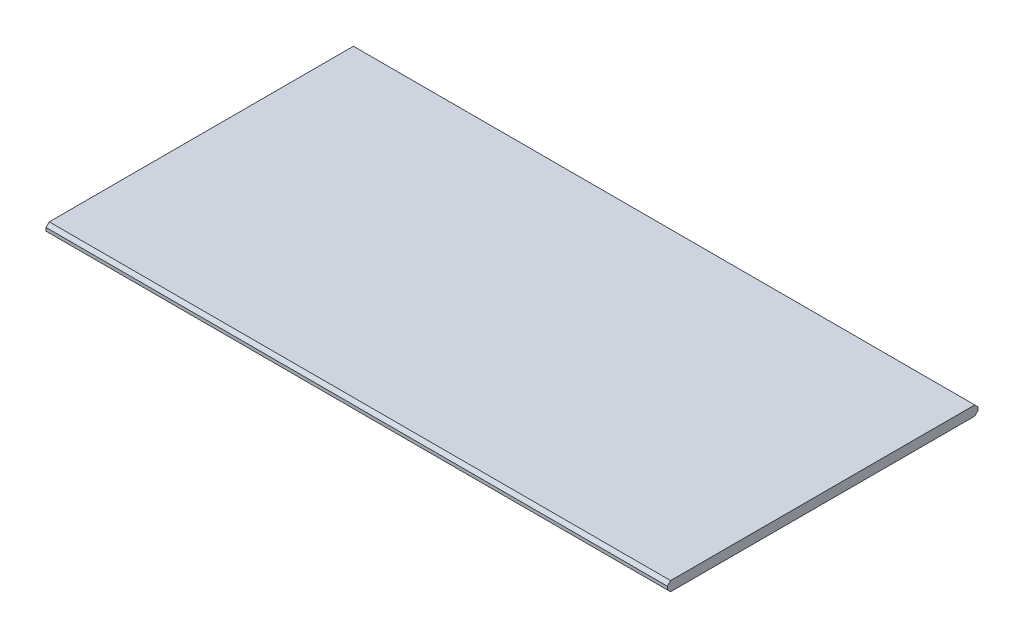
ISO-10303-21;
HEADER;
FILE_DESCRIPTION(('STEP AP214'),'2;1');
FILE_NAME('part.step','',(''),(''),'','','');
FILE_SCHEMA(('AUTOMOTIVE_DESIGN { 1 0 10303 214 1 1 1 1 }'));
ENDSEC;
DATA;
#1=APPLICATION_CONTEXT('core data for automotive mechanical design processes');
#2=APPLICATION_PROTOCOL_DEFINITION('international standard','automotive_design',2000,#1);
#3=PRODUCT_CONTEXT('',#1,'mechanical');
#4=PRODUCT('Part','Part','',(#3));
#5=PRODUCT_RELATED_PRODUCT_CATEGORY('part','',(#4));
#6=PRODUCT_DEFINITION_FORMATION('','',#4);
#7=PRODUCT_DEFINITION_CONTEXT('part definition',#1,'design');
#8=PRODUCT_DEFINITION('design','',#6,#7);
#9=PRODUCT_DEFINITION_SHAPE('','',#8);
#10=(LENGTH_UNIT() NAMED_UNIT(*) SI_UNIT(.MILLI.,.METRE.));
#11=(NAMED_UNIT(*) PLANE_ANGLE_UNIT() SI_UNIT($,.RADIAN.));
#12=(NAMED_UNIT(*) SI_UNIT($,.STERADIAN.) SOLID_ANGLE_UNIT());
#13=UNCERTAINTY_MEASURE_WITH_UNIT(LENGTH_MEASURE(1.E-05),#10,'distance_accuracy_value','');
#14=(GEOMETRIC_REPRESENTATION_CONTEXT(3) GLOBAL_UNCERTAINTY_ASSIGNED_CONTEXT((#13)) GLOBAL_UNIT_ASSIGNED_CONTEXT((#10,
#11,#12)) REPRESENTATION_CONTEXT('',''));
#15=CARTESIAN_POINT('',(0.,0.,0.));
#16=DIRECTION('',(0.,0.,1.));
#17=DIRECTION('',(1.,0.,0.));
#18=AXIS2_PLACEMENT_3D('',#15,#16,#17);
#19=CARTESIAN_POINT('',(609.6,9.525,-304.8));
#20=DIRECTION('',(-1.,0.,0.));
#21=DIRECTION('',(0.,0.,1.));
#22=AXIS2_PLACEMENT_3D('',#19,#20,#21);
#23=PLANE('',#22);
#24=DIRECTION('',(0.,0.,-1.));
#25=VECTOR('',#24,1.);
#26=CARTESIAN_POINT('',(609.6,-9.525,-304.8));
#27=LINE('',#26,#25);
#28=CARTESIAN_POINT('',(609.6,-9.525,298.45));
#29=VERTEX_POINT('',#28);
#30=CARTESIAN_POINT('',(609.6,-9.525,-298.45));
#31=VERTEX_POINT('',#30);
#32=EDGE_CURVE('E170',#29,#31,#27,.T.);
#33=ORIENTED_EDGE('',*,*,#32,.T.);
#34=DIRECTION('',(0.,-0.707106781186548,0.707106781186548));
#35=VECTOR('',#34,1.);
#36=CARTESIAN_POINT('',(609.6,-3.17499999999981,-304.8));
#37=LINE('',#36,#35);
#38=CARTESIAN_POINT('',(609.6,-3.17500000000003,-304.8));
#39=VERTEX_POINT('',#38);
#40=EDGE_CURVE('E144',#31,#39,#37,.F.);
#41=ORIENTED_EDGE('',*,*,#40,.T.);
#42=DIRECTION('',(0.,-1.,0.));
#43=VECTOR('',#42,1.);
#44=CARTESIAN_POINT('',(609.6,9.525,-304.8));
#45=LINE('',#44,#43);
#46=CARTESIAN_POINT('',(609.6,3.17500000000003,-304.8));
#47=VERTEX_POINT('',#46);
#48=EDGE_CURVE('E123',#47,#39,#45,.T.);
#49=ORIENTED_EDGE('',*,*,#48,.F.);
#50=DIRECTION('',(0.,0.707106781186541,0.707106781186554));
#51=VECTOR('',#50,1.);
#52=CARTESIAN_POINT('',(609.6,9.52499999999989,-298.45));
#53=LINE('',#52,#51);
#54=CARTESIAN_POINT('',(609.6,9.525,-298.45));
#55=VERTEX_POINT('',#54);
#56=EDGE_CURVE('E128',#47,#55,#53,.T.);
#57=ORIENTED_EDGE('',*,*,#56,.T.);
#58=DIRECTION('',(0.,0.,-1.));
#59=VECTOR('',#58,1.);
#60=CARTESIAN_POINT('',(609.6,9.525,-304.8));
#61=LINE('',#60,#59);
#62=CARTESIAN_POINT('',(609.6,9.52500000000006,298.45));
#63=VERTEX_POINT('',#62);
#64=EDGE_CURVE('E165',#63,#55,#61,.T.);
#65=ORIENTED_EDGE('',*,*,#64,.F.);
#66=DIRECTION('',(0.,-0.707106781186541,0.707106781186554));
#67=VECTOR('',#66,1.);
#68=CARTESIAN_POINT('',(609.6,9.52500000000011,298.45));
#69=LINE('',#68,#67);
#70=CARTESIAN_POINT('',(609.6,3.17500000000015,304.8));
#71=VERTEX_POINT('',#70);
#72=EDGE_CURVE('E58',#63,#71,#69,.T.);
#73=ORIENTED_EDGE('',*,*,#72,.T.);
#74=DIRECTION('',(0.,-1.,0.));
#75=VECTOR('',#74,1.);
#76=CARTESIAN_POINT('',(609.6,9.525,304.8));
#77=LINE('',#76,#75);
#78=CARTESIAN_POINT('',(609.6,-3.17499999999992,304.8));
#79=VERTEX_POINT('',#78);
#80=EDGE_CURVE('E155',#71,#79,#77,.T.);
#81=ORIENTED_EDGE('',*,*,#80,.T.);
#82=DIRECTION('',(0.,0.707106781186548,0.707106781186548));
#83=VECTOR('',#82,1.);
#84=CARTESIAN_POINT('',(609.6,-3.17500000000014,304.8));
#85=LINE('',#84,#83);
#86=EDGE_CURVE('E51',#79,#29,#85,.F.);
#87=ORIENTED_EDGE('',*,*,#86,.T.);
#88=EDGE_LOOP('',(#33,#41,#49,#57,#65,#73,#81,#87));
#89=FACE_BOUND('',#88,.T.);
#90=ADVANCED_FACE('F36',(#89),#23,.F.);
#91=CARTESIAN_POINT('',(-609.6,9.525,-304.8));
#92=DIRECTION('',(0.,0.,1.));
#93=DIRECTION('',(1.,0.,0.));
#94=AXIS2_PLACEMENT_3D('',#91,#92,#93);
#95=PLANE('',#94);
#96=ORIENTED_EDGE('',*,*,#48,.T.);
#97=DIRECTION('',(-1.,0.,0.));
#98=VECTOR('',#97,1.);
#99=CARTESIAN_POINT('',(-609.6,-3.17500000000003,-304.8));
#100=LINE('',#99,#98);
#101=CARTESIAN_POINT('',(-609.6,-3.17500000000003,-304.8));
#102=VERTEX_POINT('',#101);
#103=EDGE_CURVE('E122',#39,#102,#100,.T.);
#104=ORIENTED_EDGE('',*,*,#103,.T.);
#105=DIRECTION('',(0.,-1.,0.));
#106=VECTOR('',#105,1.);
#107=CARTESIAN_POINT('',(-609.6,9.525,-304.8));
#108=LINE('',#107,#106);
#109=CARTESIAN_POINT('',(-609.6,3.17500000000004,-304.8));
#110=VERTEX_POINT('',#109);
#111=EDGE_CURVE('E105',#110,#102,#108,.T.);
#112=ORIENTED_EDGE('',*,*,#111,.F.);
#113=DIRECTION('',(1.,0.,0.));
#114=VECTOR('',#113,1.);
#115=CARTESIAN_POINT('',(609.6,3.17500000000003,-304.8));
#116=LINE('',#115,#114);
#117=EDGE_CURVE('E119',#110,#47,#116,.T.);
#118=ORIENTED_EDGE('',*,*,#117,.T.);
#119=EDGE_LOOP('',(#96,#104,#112,#118));
#120=FACE_BOUND('',#119,.T.);
#121=ADVANCED_FACE('F118',(#120),#95,.F.);
#122=CARTESIAN_POINT('',(-609.6,9.525,-304.8));
#123=DIRECTION('',(1.,0.,0.));
#124=DIRECTION('',(0.,0.,-1.));
#125=AXIS2_PLACEMENT_3D('',#122,#123,#124);
#126=PLANE('',#125);
#127=ORIENTED_EDGE('',*,*,#111,.T.);
#128=DIRECTION('',(0.,0.707106781186548,-0.707106781186548));
#129=VECTOR('',#128,1.);
#130=CARTESIAN_POINT('',(-609.6,-3.17500000000003,-304.8));
#131=LINE('',#130,#129);
#132=CARTESIAN_POINT('',(-609.6,-9.525,-298.45));
#133=VERTEX_POINT('',#132);
#134=EDGE_CURVE('E112',#102,#133,#131,.F.);
#135=ORIENTED_EDGE('',*,*,#134,.T.);
#136=DIRECTION('',(0.,0.,1.));
#137=VECTOR('',#136,1.);
#138=CARTESIAN_POINT('',(-609.6,-9.525,-304.8));
#139=LINE('',#138,#137);
#140=CARTESIAN_POINT('',(-609.6,-9.52500000000006,298.45));
#141=VERTEX_POINT('',#140);
#142=EDGE_CURVE('E167',#133,#141,#139,.T.);
#143=ORIENTED_EDGE('',*,*,#142,.T.);
#144=DIRECTION('',(0.,-0.707106781186548,-0.707106781186548));
#145=VECTOR('',#144,1.);
#146=CARTESIAN_POINT('',(-609.6,-3.17499999999992,304.8));
#147=LINE('',#146,#145);
#148=CARTESIAN_POINT('',(-609.6,-3.17499999999992,304.8));
#149=VERTEX_POINT('',#148);
#150=EDGE_CURVE('E113',#141,#149,#147,.F.);
#151=ORIENTED_EDGE('',*,*,#150,.T.);
#152=DIRECTION('',(0.,-1.,0.));
#153=VECTOR('',#152,1.);
#154=CARTESIAN_POINT('',(-609.6,9.525,304.8));
#155=LINE('',#154,#153);
#156=CARTESIAN_POINT('',(-609.6,3.17500000000015,304.8));
#157=VERTEX_POINT('',#156);
#158=EDGE_CURVE('E124',#157,#149,#155,.T.);
#159=ORIENTED_EDGE('',*,*,#158,.F.);
#160=DIRECTION('',(0.,0.707106781186541,-0.707106781186554));
#161=VECTOR('',#160,1.);
#162=CARTESIAN_POINT('',(-609.6,9.52499999999989,298.45));
#163=LINE('',#162,#161);
#164=CARTESIAN_POINT('',(-609.6,9.52500000000003,298.45));
#165=VERTEX_POINT('',#164);
#166=EDGE_CURVE('E130',#157,#165,#163,.T.);
#167=ORIENTED_EDGE('',*,*,#166,.T.);
#168=DIRECTION('',(0.,0.,1.));
#169=VECTOR('',#168,1.);
#170=CARTESIAN_POINT('',(-609.6,9.525,-304.8));
#171=LINE('',#170,#169);
#172=CARTESIAN_POINT('',(-609.6,9.525,-298.45));
#173=VERTEX_POINT('',#172);
#174=EDGE_CURVE('E107',#173,#165,#171,.T.);
#175=ORIENTED_EDGE('',*,*,#174,.F.);
#176=DIRECTION('',(0.,-0.707106781186541,-0.707106781186554));
#177=VECTOR('',#176,1.);
#178=CARTESIAN_POINT('',(-609.6,9.52500000000011,-298.45));
#179=LINE('',#178,#177);
#180=EDGE_CURVE('E102',#173,#110,#179,.T.);
#181=ORIENTED_EDGE('',*,*,#180,.T.);
#182=EDGE_LOOP('',(#127,#135,#143,#151,#159,#167,#175,#181));
#183=FACE_BOUND('',#182,.T.);
#184=ADVANCED_FACE('F104',(#183),#126,.F.);
#185=CARTESIAN_POINT('',(-609.6,9.525,304.8));
#186=DIRECTION('',(0.,0.,-1.));
#187=DIRECTION('',(-1.,0.,0.));
#188=AXIS2_PLACEMENT_3D('',#185,#186,#187);
#189=PLANE('',#188);
#190=ORIENTED_EDGE('',*,*,#158,.T.);
#191=DIRECTION('',(1.,0.,0.));
#192=VECTOR('',#191,1.);
#193=CARTESIAN_POINT('',(-609.6,-3.17499999999992,304.8));
#194=LINE('',#193,#192);
#195=EDGE_CURVE('E11',#149,#79,#194,.T.);
#196=ORIENTED_EDGE('',*,*,#195,.T.);
#197=ORIENTED_EDGE('',*,*,#80,.F.);
#198=DIRECTION('',(-1.,0.,0.));
#199=VECTOR('',#198,1.);
#200=CARTESIAN_POINT('',(-609.6,3.17500000000015,304.8));
#201=LINE('',#200,#199);
#202=EDGE_CURVE('E44',#71,#157,#201,.T.);
#203=ORIENTED_EDGE('',*,*,#202,.T.);
#204=EDGE_LOOP('',(#190,#196,#197,#203));
#205=FACE_BOUND('',#204,.T.);
#206=ADVANCED_FACE('F154',(#205),#189,.F.);
#207=CARTESIAN_POINT('',(0.,9.525,0.));
#208=DIRECTION('',(0.,1.,0.));
#209=DIRECTION('',(0.,0.,1.));
#210=AXIS2_PLACEMENT_3D('',#207,#208,#209);
#211=PLANE('',#210);
#212=ORIENTED_EDGE('',*,*,#64,.T.);
#213=DIRECTION('',(-1.,0.,0.));
#214=VECTOR('',#213,1.);
#215=CARTESIAN_POINT('',(-609.6,9.525,-298.45));
#216=LINE('',#215,#214);
#217=EDGE_CURVE('E149',#55,#173,#216,.T.);
#218=ORIENTED_EDGE('',*,*,#217,.T.);
#219=ORIENTED_EDGE('',*,*,#174,.T.);
#220=DIRECTION('',(1.,0.,0.));
#221=VECTOR('',#220,1.);
#222=CARTESIAN_POINT('',(609.6,9.525,298.45));
#223=LINE('',#222,#221);
#224=EDGE_CURVE('E146',#165,#63,#223,.T.);
#225=ORIENTED_EDGE('',*,*,#224,.T.);
#226=EDGE_LOOP('',(#212,#218,#219,#225));
#227=FACE_BOUND('',#226,.T.);
#228=ADVANCED_FACE('F164',(#227),#211,.T.);
#229=CARTESIAN_POINT('',(0.,-9.525,0.));
#230=DIRECTION('',(0.,1.,0.));
#231=DIRECTION('',(0.,0.,1.));
#232=AXIS2_PLACEMENT_3D('',#229,#230,#231);
#233=PLANE('',#232);
#234=ORIENTED_EDGE('',*,*,#142,.F.);
#235=DIRECTION('',(1.,0.,0.));
#236=VECTOR('',#235,1.);
#237=CARTESIAN_POINT('',(0.,-9.525,-298.45));
#238=LINE('',#237,#236);
#239=EDGE_CURVE('E139',#133,#31,#238,.T.);
#240=ORIENTED_EDGE('',*,*,#239,.T.);
#241=ORIENTED_EDGE('',*,*,#32,.F.);
#242=DIRECTION('',(-1.,0.,0.));
#243=VECTOR('',#242,1.);
#244=CARTESIAN_POINT('',(0.,-9.525,298.45));
#245=LINE('',#244,#243);
#246=EDGE_CURVE('E137',#29,#141,#245,.T.);
#247=ORIENTED_EDGE('',*,*,#246,.T.);
#248=EDGE_LOOP('',(#234,#240,#241,#247));
#249=FACE_BOUND('',#248,.T.);
#250=ADVANCED_FACE('F178',(#249),#233,.F.);
#251=CARTESIAN_POINT('',(-609.6,-3.17500000000003,-304.8));
#252=DIRECTION('',(0.,0.707106781186548,0.707106781186548));
#253=DIRECTION('',(-1.,0.,0.));
#254=AXIS2_PLACEMENT_3D('',#251,#252,#253);
#255=PLANE('',#254);
#256=ORIENTED_EDGE('',*,*,#40,.F.);
#257=ORIENTED_EDGE('',*,*,#239,.F.);
#258=ORIENTED_EDGE('',*,*,#134,.F.);
#259=ORIENTED_EDGE('',*,*,#103,.F.);
#260=EDGE_LOOP('',(#256,#257,#258,#259));
#261=FACE_BOUND('',#260,.T.);
#262=ADVANCED_FACE('F186',(#261),#255,.F.);
#263=CARTESIAN_POINT('',(0.,9.525,-298.45));
#264=DIRECTION('',(0.,0.707106781186554,-0.707106781186541));
#265=DIRECTION('',(1.,0.,0.));
#266=AXIS2_PLACEMENT_3D('',#263,#264,#265);
#267=PLANE('',#266);
#268=ORIENTED_EDGE('',*,*,#56,.F.);
#269=ORIENTED_EDGE('',*,*,#117,.F.);
#270=ORIENTED_EDGE('',*,*,#180,.F.);
#271=ORIENTED_EDGE('',*,*,#217,.F.);
#272=EDGE_LOOP('',(#268,#269,#270,#271));
#273=FACE_BOUND('',#272,.T.);
#274=ADVANCED_FACE('F127',(#273),#267,.T.);
#275=CARTESIAN_POINT('',(-609.6,-3.17499999999992,304.8));
#276=DIRECTION('',(0.,0.707106781186548,-0.707106781186548));
#277=DIRECTION('',(1.,0.,0.));
#278=AXIS2_PLACEMENT_3D('',#275,#276,#277);
#279=PLANE('',#278);
#280=ORIENTED_EDGE('',*,*,#150,.F.);
#281=ORIENTED_EDGE('',*,*,#246,.F.);
#282=ORIENTED_EDGE('',*,*,#86,.F.);
#283=ORIENTED_EDGE('',*,*,#195,.F.);
#284=EDGE_LOOP('',(#280,#281,#282,#283));
#285=FACE_BOUND('',#284,.T.);
#286=ADVANCED_FACE('F180',(#285),#279,.F.);
#287=CARTESIAN_POINT('',(0.,9.525,298.45));
#288=DIRECTION('',(0.,0.707106781186554,0.707106781186541));
#289=DIRECTION('',(-1.,0.,0.));
#290=AXIS2_PLACEMENT_3D('',#287,#288,#289);
#291=PLANE('',#290);
#292=ORIENTED_EDGE('',*,*,#166,.F.);
#293=ORIENTED_EDGE('',*,*,#202,.F.);
#294=ORIENTED_EDGE('',*,*,#72,.F.);
#295=ORIENTED_EDGE('',*,*,#224,.F.);
#296=EDGE_LOOP('',(#292,#293,#294,#295));
#297=FACE_BOUND('',#296,.T.);
#298=ADVANCED_FACE('F38',(#297),#291,.T.);
#299=CLOSED_SHELL('',(#90,#121,#184,#206,#228,#250,#262,#274,#286,#298));
#300=MANIFOLD_SOLID_BREP('B2',#299);
#301=ADVANCED_BREP_SHAPE_REPRESENTATION('',(#18,#300),#14);
#302=SHAPE_DEFINITION_REPRESENTATION(#9,#301);
ENDSEC;
END-ISO-10303-21;
